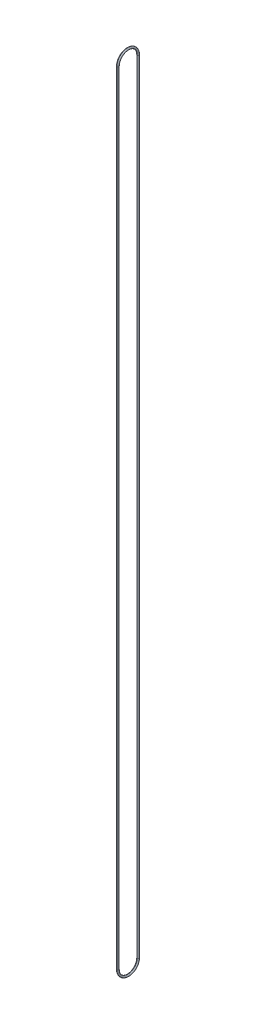
ISO-10303-21;
HEADER;
FILE_DESCRIPTION(('STEP AP214'),'2;1');
FILE_NAME('part.step','',(''),(''),'','','');
FILE_SCHEMA(('AUTOMOTIVE_DESIGN { 1 0 10303 214 1 1 1 1 }'));
ENDSEC;
DATA;
#1=APPLICATION_CONTEXT('core data for automotive mechanical design processes');
#2=APPLICATION_PROTOCOL_DEFINITION('international standard','automotive_design',2000,#1);
#3=PRODUCT_CONTEXT('',#1,'mechanical');
#4=PRODUCT('Part','Part','',(#3));
#5=PRODUCT_RELATED_PRODUCT_CATEGORY('part','',(#4));
#6=PRODUCT_DEFINITION_FORMATION('','',#4);
#7=PRODUCT_DEFINITION_CONTEXT('part definition',#1,'design');
#8=PRODUCT_DEFINITION('design','',#6,#7);
#9=PRODUCT_DEFINITION_SHAPE('','',#8);
#10=(LENGTH_UNIT() NAMED_UNIT(*) SI_UNIT(.MILLI.,.METRE.));
#11=(NAMED_UNIT(*) PLANE_ANGLE_UNIT() SI_UNIT($,.RADIAN.));
#12=(NAMED_UNIT(*) SI_UNIT($,.STERADIAN.) SOLID_ANGLE_UNIT());
#13=UNCERTAINTY_MEASURE_WITH_UNIT(LENGTH_MEASURE(1.E-05),#10,'distance_accuracy_value','');
#14=(GEOMETRIC_REPRESENTATION_CONTEXT(3) GLOBAL_UNCERTAINTY_ASSIGNED_CONTEXT((#13)) GLOBAL_UNIT_ASSIGNED_CONTEXT((#10,
#11,#12)) REPRESENTATION_CONTEXT('',''));
#15=CARTESIAN_POINT('',(0.,0.,0.));
#16=DIRECTION('',(0.,0.,1.));
#17=DIRECTION('',(1.,0.,0.));
#18=AXIS2_PLACEMENT_3D('',#15,#16,#17);
#19=CARTESIAN_POINT('',(0.,1219.2,15.7875));
#20=DIRECTION('',(0.,-1.,0.));
#21=DIRECTION('',(0.,0.,-1.));
#22=AXIS2_PLACEMENT_3D('',#19,#20,#21);
#23=CYLINDRICAL_SURFACE('',#22,1.5);
#24=DIRECTION('',(0.,-1.,0.));
#25=VECTOR('',#24,1.);
#26=CARTESIAN_POINT('',(0.,1219.2,17.2875));
#27=LINE('',#26,#25);
#28=CARTESIAN_POINT('',(0.,1219.2,17.2875));
#29=VERTEX_POINT('',#28);
#30=CARTESIAN_POINT('',(0.,0.,17.2875));
#31=VERTEX_POINT('',#30);
#32=EDGE_CURVE('E103',#29,#31,#27,.T.);
#33=ORIENTED_EDGE('',*,*,#32,.F.);
#34=CARTESIAN_POINT('',(0.,1219.2,15.7875));
#35=DIRECTION('',(0.,1.,0.));
#36=DIRECTION('',(0.,0.,1.));
#37=AXIS2_PLACEMENT_3D('',#34,#35,#36);
#38=CIRCLE('',#37,1.5);
#39=CARTESIAN_POINT('',(0.,1219.2,14.2875));
#40=VERTEX_POINT('',#39);
#41=EDGE_CURVE('E11',#40,#29,#38,.T.);
#42=ORIENTED_EDGE('',*,*,#41,.F.);
#43=DIRECTION('',(0.,-1.,0.));
#44=VECTOR('',#43,1.);
#45=CARTESIAN_POINT('',(0.,1219.2,14.2875));
#46=LINE('',#45,#44);
#47=CARTESIAN_POINT('',(0.,0.,14.2875));
#48=VERTEX_POINT('',#47);
#49=EDGE_CURVE('E99',#40,#48,#46,.T.);
#50=ORIENTED_EDGE('',*,*,#49,.T.);
#51=CARTESIAN_POINT('',(0.,0.,15.7875));
#52=DIRECTION('',(0.,1.,0.));
#53=DIRECTION('',(0.,0.,1.));
#54=AXIS2_PLACEMENT_3D('',#51,#52,#53);
#55=CIRCLE('',#54,1.5);
#56=EDGE_CURVE('E78',#48,#31,#55,.T.);
#57=ORIENTED_EDGE('',*,*,#56,.T.);
#58=EDGE_LOOP('',(#33,#42,#50,#57));
#59=FACE_BOUND('',#58,.T.);
#60=ADVANCED_FACE('F16',(#59),#23,.T.);
#61=CARTESIAN_POINT('',(0.,1219.2,0.));
#62=DIRECTION('',(1.,0.,0.));
#63=DIRECTION('',(0.,0.,-1.));
#64=AXIS2_PLACEMENT_3D('',#61,#62,#63);
#65=TOROIDAL_SURFACE('',#64,15.7875,1.5);
#66=CARTESIAN_POINT('',(0.,1219.2,0.));
#67=DIRECTION('',(1.,0.,0.));
#68=DIRECTION('',(0.,0.,-1.));
#69=AXIS2_PLACEMENT_3D('',#66,#67,#68);
#70=CIRCLE('',#69,17.2875);
#71=CARTESIAN_POINT('',(0.,1219.2,-17.2875));
#72=VERTEX_POINT('',#71);
#73=EDGE_CURVE('E68',#72,#29,#70,.T.);
#74=ORIENTED_EDGE('',*,*,#73,.F.);
#75=CARTESIAN_POINT('',(0.,1219.2,-15.7875));
#76=DIRECTION('',(0.,-1.,0.));
#77=DIRECTION('',(0.,0.,-1.));
#78=AXIS2_PLACEMENT_3D('',#75,#76,#77);
#79=CIRCLE('',#78,1.5);
#80=CARTESIAN_POINT('',(0.,1219.2,-14.2875));
#81=VERTEX_POINT('',#80);
#82=EDGE_CURVE('E26',#81,#72,#79,.T.);
#83=ORIENTED_EDGE('',*,*,#82,.F.);
#84=CARTESIAN_POINT('',(0.,1219.2,0.));
#85=DIRECTION('',(1.,0.,0.));
#86=DIRECTION('',(0.,0.,-1.));
#87=AXIS2_PLACEMENT_3D('',#84,#85,#86);
#88=CIRCLE('',#87,14.2875);
#89=EDGE_CURVE('E65',#81,#40,#88,.T.);
#90=ORIENTED_EDGE('',*,*,#89,.T.);
#91=ORIENTED_EDGE('',*,*,#41,.T.);
#92=EDGE_LOOP('',(#74,#83,#90,#91));
#93=FACE_BOUND('',#92,.T.);
#94=ADVANCED_FACE('F63',(#93),#65,.T.);
#95=CARTESIAN_POINT('',(0.,0.,-15.7875));
#96=DIRECTION('',(0.,1.,0.));
#97=DIRECTION('',(0.,0.,1.));
#98=AXIS2_PLACEMENT_3D('',#95,#96,#97);
#99=CYLINDRICAL_SURFACE('',#98,1.5);
#100=DIRECTION('',(0.,1.,0.));
#101=VECTOR('',#100,1.);
#102=CARTESIAN_POINT('',(0.,0.,-17.2875));
#103=LINE('',#102,#101);
#104=CARTESIAN_POINT('',(0.,0.,-17.2875));
#105=VERTEX_POINT('',#104);
#106=EDGE_CURVE('E79',#105,#72,#103,.T.);
#107=ORIENTED_EDGE('',*,*,#106,.F.);
#108=CARTESIAN_POINT('',(0.,0.,-15.7875));
#109=DIRECTION('',(0.,-1.,0.));
#110=DIRECTION('',(0.,0.,-1.));
#111=AXIS2_PLACEMENT_3D('',#108,#109,#110);
#112=CIRCLE('',#111,1.5);
#113=CARTESIAN_POINT('',(0.,0.,-14.2875));
#114=VERTEX_POINT('',#113);
#115=EDGE_CURVE('E40',#114,#105,#112,.T.);
#116=ORIENTED_EDGE('',*,*,#115,.F.);
#117=DIRECTION('',(0.,1.,0.));
#118=VECTOR('',#117,1.);
#119=CARTESIAN_POINT('',(0.,0.,-14.2875));
#120=LINE('',#119,#118);
#121=EDGE_CURVE('E19',#114,#81,#120,.T.);
#122=ORIENTED_EDGE('',*,*,#121,.T.);
#123=ORIENTED_EDGE('',*,*,#82,.T.);
#124=EDGE_LOOP('',(#107,#116,#122,#123));
#125=FACE_BOUND('',#124,.T.);
#126=ADVANCED_FACE('F72',(#125),#99,.T.);
#127=CARTESIAN_POINT('',(0.,0.,0.));
#128=DIRECTION('',(1.,0.,0.));
#129=DIRECTION('',(0.,0.,-1.));
#130=AXIS2_PLACEMENT_3D('',#127,#128,#129);
#131=TOROIDAL_SURFACE('',#130,15.7875,1.5);
#132=CARTESIAN_POINT('',(0.,0.,0.));
#133=DIRECTION('',(1.,0.,0.));
#134=DIRECTION('',(0.,0.,-1.));
#135=AXIS2_PLACEMENT_3D('',#132,#133,#134);
#136=CIRCLE('',#135,17.2875);
#137=EDGE_CURVE('E109',#31,#105,#136,.T.);
#138=ORIENTED_EDGE('',*,*,#137,.F.);
#139=ORIENTED_EDGE('',*,*,#56,.F.);
#140=CARTESIAN_POINT('',(0.,0.,0.));
#141=DIRECTION('',(1.,0.,0.));
#142=DIRECTION('',(0.,0.,-1.));
#143=AXIS2_PLACEMENT_3D('',#140,#141,#142);
#144=CIRCLE('',#143,14.2875);
#145=EDGE_CURVE('E108',#48,#114,#144,.T.);
#146=ORIENTED_EDGE('',*,*,#145,.T.);
#147=ORIENTED_EDGE('',*,*,#115,.T.);
#148=EDGE_LOOP('',(#138,#139,#146,#147));
#149=FACE_BOUND('',#148,.T.);
#150=ADVANCED_FACE('F240',(#149),#131,.T.);
#151=CARTESIAN_POINT('',(0.,0.,-15.7875));
#152=DIRECTION('',(0.,1.,0.));
#153=DIRECTION('',(0.,0.,1.));
#154=AXIS2_PLACEMENT_3D('',#151,#152,#153);
#155=CYLINDRICAL_SURFACE('',#154,1.5);
#156=CARTESIAN_POINT('',(0.,0.,-15.7875));
#157=DIRECTION('',(0.,-1.,0.));
#158=DIRECTION('',(0.,0.,-1.));
#159=AXIS2_PLACEMENT_3D('',#156,#157,#158);
#160=CIRCLE('',#159,1.5);
#161=EDGE_CURVE('E104',#105,#114,#160,.T.);
#162=ORIENTED_EDGE('',*,*,#161,.F.);
#163=ORIENTED_EDGE('',*,*,#106,.T.);
#164=CARTESIAN_POINT('',(0.,1219.2,-15.7875));
#165=DIRECTION('',(0.,-1.,0.));
#166=DIRECTION('',(0.,0.,-1.));
#167=AXIS2_PLACEMENT_3D('',#164,#165,#166);
#168=CIRCLE('',#167,1.5);
#169=EDGE_CURVE('E82',#72,#81,#168,.T.);
#170=ORIENTED_EDGE('',*,*,#169,.T.);
#171=ORIENTED_EDGE('',*,*,#121,.F.);
#172=EDGE_LOOP('',(#162,#163,#170,#171));
#173=FACE_BOUND('',#172,.T.);
#174=ADVANCED_FACE('F88',(#173),#155,.T.);
#175=CARTESIAN_POINT('',(0.,1219.2,15.7875));
#176=DIRECTION('',(0.,-1.,0.));
#177=DIRECTION('',(0.,0.,-1.));
#178=AXIS2_PLACEMENT_3D('',#175,#176,#177);
#179=CYLINDRICAL_SURFACE('',#178,1.5);
#180=CARTESIAN_POINT('',(0.,1219.2,15.7875));
#181=DIRECTION('',(0.,1.,0.));
#182=DIRECTION('',(0.,0.,1.));
#183=AXIS2_PLACEMENT_3D('',#180,#181,#182);
#184=CIRCLE('',#183,1.5);
#185=EDGE_CURVE('E84',#29,#40,#184,.T.);
#186=ORIENTED_EDGE('',*,*,#185,.F.);
#187=ORIENTED_EDGE('',*,*,#32,.T.);
#188=CARTESIAN_POINT('',(0.,0.,15.7875));
#189=DIRECTION('',(0.,1.,0.));
#190=DIRECTION('',(0.,0.,1.));
#191=AXIS2_PLACEMENT_3D('',#188,#189,#190);
#192=CIRCLE('',#191,1.5);
#193=EDGE_CURVE('E86',#31,#48,#192,.T.);
#194=ORIENTED_EDGE('',*,*,#193,.T.);
#195=ORIENTED_EDGE('',*,*,#49,.F.);
#196=EDGE_LOOP('',(#186,#187,#194,#195));
#197=FACE_BOUND('',#196,.T.);
#198=ADVANCED_FACE('F124',(#197),#179,.T.);
#199=CARTESIAN_POINT('',(0.,0.,0.));
#200=DIRECTION('',(1.,0.,0.));
#201=DIRECTION('',(0.,0.,-1.));
#202=AXIS2_PLACEMENT_3D('',#199,#200,#201);
#203=TOROIDAL_SURFACE('',#202,15.7875,1.5);
#204=ORIENTED_EDGE('',*,*,#193,.F.);
#205=ORIENTED_EDGE('',*,*,#137,.T.);
#206=ORIENTED_EDGE('',*,*,#161,.T.);
#207=ORIENTED_EDGE('',*,*,#145,.F.);
#208=EDGE_LOOP('',(#204,#205,#206,#207));
#209=FACE_BOUND('',#208,.T.);
#210=ADVANCED_FACE('F133',(#209),#203,.T.);
#211=CARTESIAN_POINT('',(0.,1219.2,0.));
#212=DIRECTION('',(1.,0.,0.));
#213=DIRECTION('',(0.,0.,-1.));
#214=AXIS2_PLACEMENT_3D('',#211,#212,#213);
#215=TOROIDAL_SURFACE('',#214,15.7875,1.5);
#216=ORIENTED_EDGE('',*,*,#169,.F.);
#217=ORIENTED_EDGE('',*,*,#73,.T.);
#218=ORIENTED_EDGE('',*,*,#185,.T.);
#219=ORIENTED_EDGE('',*,*,#89,.F.);
#220=EDGE_LOOP('',(#216,#217,#218,#219));
#221=FACE_BOUND('',#220,.T.);
#222=ADVANCED_FACE('F81',(#221),#215,.T.);
#223=CLOSED_SHELL('',(#60,#94,#126,#150,#174,#198,#210,#222));
#224=MANIFOLD_SOLID_BREP('B1',#223);
#225=ADVANCED_BREP_SHAPE_REPRESENTATION('',(#18,#224),#14);
#226=SHAPE_DEFINITION_REPRESENTATION(#9,#225);
ENDSEC;
END-ISO-10303-21;
